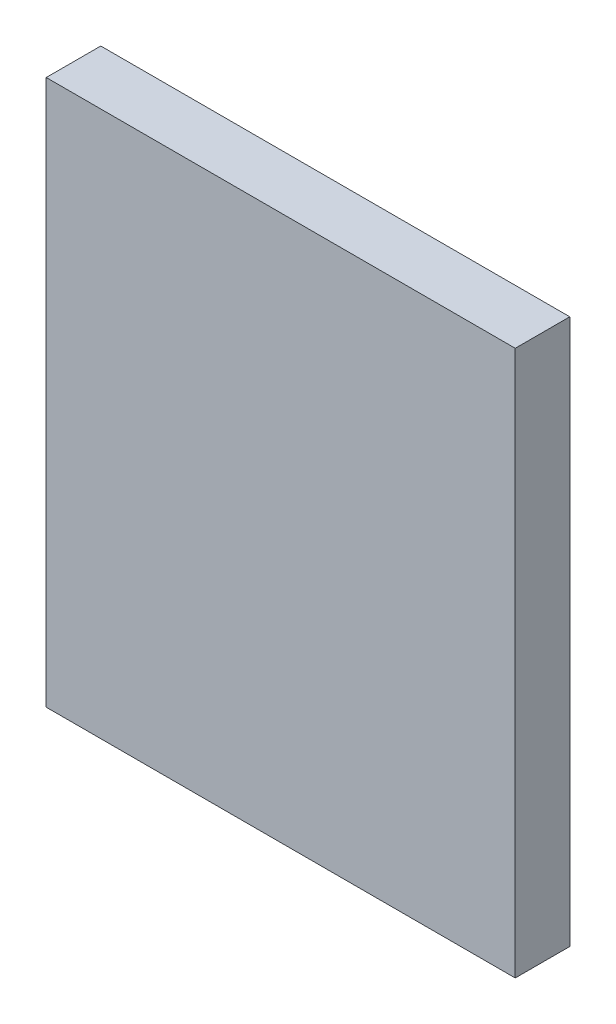
ISO-10303-21;
HEADER;
FILE_DESCRIPTION(('STEP AP214'),'2;1');
FILE_NAME('part.step','',(''),(''),'','','');
FILE_SCHEMA(('AUTOMOTIVE_DESIGN { 1 0 10303 214 1 1 1 1 }'));
ENDSEC;
DATA;
#1=APPLICATION_CONTEXT('core data for automotive mechanical design processes');
#2=APPLICATION_PROTOCOL_DEFINITION('international standard','automotive_design',2000,#1);
#3=PRODUCT_CONTEXT('',#1,'mechanical');
#4=PRODUCT('Part','Part','',(#3));
#5=PRODUCT_RELATED_PRODUCT_CATEGORY('part','',(#4));
#6=PRODUCT_DEFINITION_FORMATION('','',#4);
#7=PRODUCT_DEFINITION_CONTEXT('part definition',#1,'design');
#8=PRODUCT_DEFINITION('design','',#6,#7);
#9=PRODUCT_DEFINITION_SHAPE('','',#8);
#10=(LENGTH_UNIT() NAMED_UNIT(*) SI_UNIT(.MILLI.,.METRE.));
#11=(NAMED_UNIT(*) PLANE_ANGLE_UNIT() SI_UNIT($,.RADIAN.));
#12=(NAMED_UNIT(*) SI_UNIT($,.STERADIAN.) SOLID_ANGLE_UNIT());
#13=UNCERTAINTY_MEASURE_WITH_UNIT(LENGTH_MEASURE(1.E-05),#10,'distance_accuracy_value','');
#14=(GEOMETRIC_REPRESENTATION_CONTEXT(3) GLOBAL_UNCERTAINTY_ASSIGNED_CONTEXT((#13)) GLOBAL_UNIT_ASSIGNED_CONTEXT((#10,
#11,#12)) REPRESENTATION_CONTEXT('',''));
#15=CARTESIAN_POINT('',(0.,0.,0.));
#16=DIRECTION('',(0.,0.,1.));
#17=DIRECTION('',(1.,0.,0.));
#18=AXIS2_PLACEMENT_3D('',#15,#16,#17);
#19=CARTESIAN_POINT('',(0.,0.,25.));
#20=DIRECTION('',(1.,0.,0.));
#21=DIRECTION('',(0.,0.,-1.));
#22=AXIS2_PLACEMENT_3D('',#19,#20,#21);
#23=PLANE('',#22);
#24=DIRECTION('',(0.,-1.,0.));
#25=VECTOR('',#24,1.);
#26=CARTESIAN_POINT('',(0.,0.,0.));
#27=LINE('',#26,#25);
#28=CARTESIAN_POINT('',(0.,250.,0.));
#29=VERTEX_POINT('',#28);
#30=CARTESIAN_POINT('',(0.,0.,0.));
#31=VERTEX_POINT('',#30);
#32=EDGE_CURVE('E111',#29,#31,#27,.T.);
#33=ORIENTED_EDGE('',*,*,#32,.T.);
#34=DIRECTION('',(0.,0.,-1.));
#35=VECTOR('',#34,1.);
#36=CARTESIAN_POINT('',(0.,0.,25.));
#37=LINE('',#36,#35);
#38=CARTESIAN_POINT('',(0.,0.,25.));
#39=VERTEX_POINT('',#38);
#40=EDGE_CURVE('E11',#39,#31,#37,.T.);
#41=ORIENTED_EDGE('',*,*,#40,.F.);
#42=DIRECTION('',(0.,-1.,0.));
#43=VECTOR('',#42,1.);
#44=CARTESIAN_POINT('',(0.,0.,25.));
#45=LINE('',#44,#43);
#46=CARTESIAN_POINT('',(0.,250.,25.));
#47=VERTEX_POINT('',#46);
#48=EDGE_CURVE('E95',#47,#39,#45,.T.);
#49=ORIENTED_EDGE('',*,*,#48,.F.);
#50=DIRECTION('',(0.,0.,-1.));
#51=VECTOR('',#50,1.);
#52=CARTESIAN_POINT('',(0.,250.,25.));
#53=LINE('',#52,#51);
#54=EDGE_CURVE('E107',#47,#29,#53,.T.);
#55=ORIENTED_EDGE('',*,*,#54,.T.);
#56=EDGE_LOOP('',(#33,#41,#49,#55));
#57=FACE_BOUND('',#56,.T.);
#58=ADVANCED_FACE('F43',(#57),#23,.F.);
#59=CARTESIAN_POINT('',(0.,0.,25.));
#60=DIRECTION('',(0.,1.,0.));
#61=DIRECTION('',(0.,0.,1.));
#62=AXIS2_PLACEMENT_3D('',#59,#60,#61);
#63=PLANE('',#62);
#64=DIRECTION('',(1.,0.,0.));
#65=VECTOR('',#64,1.);
#66=CARTESIAN_POINT('',(0.,0.,0.));
#67=LINE('',#66,#65);
#68=CARTESIAN_POINT('',(215.,0.,0.));
#69=VERTEX_POINT('',#68);
#70=EDGE_CURVE('E100',#31,#69,#67,.T.);
#71=ORIENTED_EDGE('',*,*,#70,.T.);
#72=DIRECTION('',(0.,0.,-1.));
#73=VECTOR('',#72,1.);
#74=CARTESIAN_POINT('',(215.,0.,25.));
#75=LINE('',#74,#73);
#76=CARTESIAN_POINT('',(215.,0.,25.));
#77=VERTEX_POINT('',#76);
#78=EDGE_CURVE('E52',#77,#69,#75,.T.);
#79=ORIENTED_EDGE('',*,*,#78,.F.);
#80=DIRECTION('',(1.,0.,0.));
#81=VECTOR('',#80,1.);
#82=CARTESIAN_POINT('',(0.,0.,25.));
#83=LINE('',#82,#81);
#84=EDGE_CURVE('E90',#39,#77,#83,.T.);
#85=ORIENTED_EDGE('',*,*,#84,.F.);
#86=ORIENTED_EDGE('',*,*,#40,.T.);
#87=EDGE_LOOP('',(#71,#79,#85,#86));
#88=FACE_BOUND('',#87,.T.);
#89=ADVANCED_FACE('F99',(#88),#63,.F.);
#90=CARTESIAN_POINT('',(215.,0.,25.));
#91=DIRECTION('',(-1.,0.,0.));
#92=DIRECTION('',(0.,0.,1.));
#93=AXIS2_PLACEMENT_3D('',#90,#91,#92);
#94=PLANE('',#93);
#95=DIRECTION('',(0.,1.,0.));
#96=VECTOR('',#95,1.);
#97=CARTESIAN_POINT('',(215.,0.,0.));
#98=LINE('',#97,#96);
#99=CARTESIAN_POINT('',(215.,250.,0.));
#100=VERTEX_POINT('',#99);
#101=EDGE_CURVE('E77',#69,#100,#98,.T.);
#102=ORIENTED_EDGE('',*,*,#101,.T.);
#103=DIRECTION('',(0.,0.,-1.));
#104=VECTOR('',#103,1.);
#105=CARTESIAN_POINT('',(215.,250.,25.));
#106=LINE('',#105,#104);
#107=CARTESIAN_POINT('',(215.,250.,25.));
#108=VERTEX_POINT('',#107);
#109=EDGE_CURVE('E102',#108,#100,#106,.T.);
#110=ORIENTED_EDGE('',*,*,#109,.F.);
#111=DIRECTION('',(0.,1.,0.));
#112=VECTOR('',#111,1.);
#113=CARTESIAN_POINT('',(215.,0.,25.));
#114=LINE('',#113,#112);
#115=EDGE_CURVE('E93',#77,#108,#114,.T.);
#116=ORIENTED_EDGE('',*,*,#115,.F.);
#117=ORIENTED_EDGE('',*,*,#78,.T.);
#118=EDGE_LOOP('',(#102,#110,#116,#117));
#119=FACE_BOUND('',#118,.T.);
#120=ADVANCED_FACE('F103',(#119),#94,.F.);
#121=CARTESIAN_POINT('',(0.,250.,25.));
#122=DIRECTION('',(0.,-1.,0.));
#123=DIRECTION('',(0.,0.,-1.));
#124=AXIS2_PLACEMENT_3D('',#121,#122,#123);
#125=PLANE('',#124);
#126=DIRECTION('',(-1.,0.,0.));
#127=VECTOR('',#126,1.);
#128=CARTESIAN_POINT('',(0.,250.,0.));
#129=LINE('',#128,#127);
#130=EDGE_CURVE('E83',#100,#29,#129,.T.);
#131=ORIENTED_EDGE('',*,*,#130,.T.);
#132=ORIENTED_EDGE('',*,*,#54,.F.);
#133=DIRECTION('',(-1.,0.,0.));
#134=VECTOR('',#133,1.);
#135=CARTESIAN_POINT('',(0.,250.,25.));
#136=LINE('',#135,#134);
#137=EDGE_CURVE('E60',#108,#47,#136,.T.);
#138=ORIENTED_EDGE('',*,*,#137,.F.);
#139=ORIENTED_EDGE('',*,*,#109,.T.);
#140=EDGE_LOOP('',(#131,#132,#138,#139));
#141=FACE_BOUND('',#140,.T.);
#142=ADVANCED_FACE('F124',(#141),#125,.F.);
#143=CARTESIAN_POINT('',(0.,0.,25.));
#144=DIRECTION('',(0.,0.,-1.));
#145=DIRECTION('',(-1.,0.,0.));
#146=AXIS2_PLACEMENT_3D('',#143,#144,#145);
#147=PLANE('',#146);
#148=ORIENTED_EDGE('',*,*,#48,.T.);
#149=ORIENTED_EDGE('',*,*,#84,.T.);
#150=ORIENTED_EDGE('',*,*,#115,.T.);
#151=ORIENTED_EDGE('',*,*,#137,.T.);
#152=EDGE_LOOP('',(#148,#149,#150,#151));
#153=FACE_BOUND('',#152,.T.);
#154=ADVANCED_FACE('F91',(#153),#147,.F.);
#155=CARTESIAN_POINT('',(0.,0.,0.));
#156=DIRECTION('',(0.,0.,-1.));
#157=DIRECTION('',(-1.,0.,0.));
#158=AXIS2_PLACEMENT_3D('',#155,#156,#157);
#159=PLANE('',#158);
#160=ORIENTED_EDGE('',*,*,#32,.F.);
#161=ORIENTED_EDGE('',*,*,#130,.F.);
#162=ORIENTED_EDGE('',*,*,#101,.F.);
#163=ORIENTED_EDGE('',*,*,#70,.F.);
#164=EDGE_LOOP('',(#160,#161,#162,#163));
#165=FACE_BOUND('',#164,.T.);
#166=ADVANCED_FACE('F127',(#165),#159,.T.);
#167=CLOSED_SHELL('',(#58,#89,#120,#142,#154,#166));
#168=MANIFOLD_SOLID_BREP('B2',#167);
#169=ADVANCED_BREP_SHAPE_REPRESENTATION('',(#18,#168),#14);
#170=SHAPE_DEFINITION_REPRESENTATION(#9,#169);
ENDSEC;
END-ISO-10303-21;
